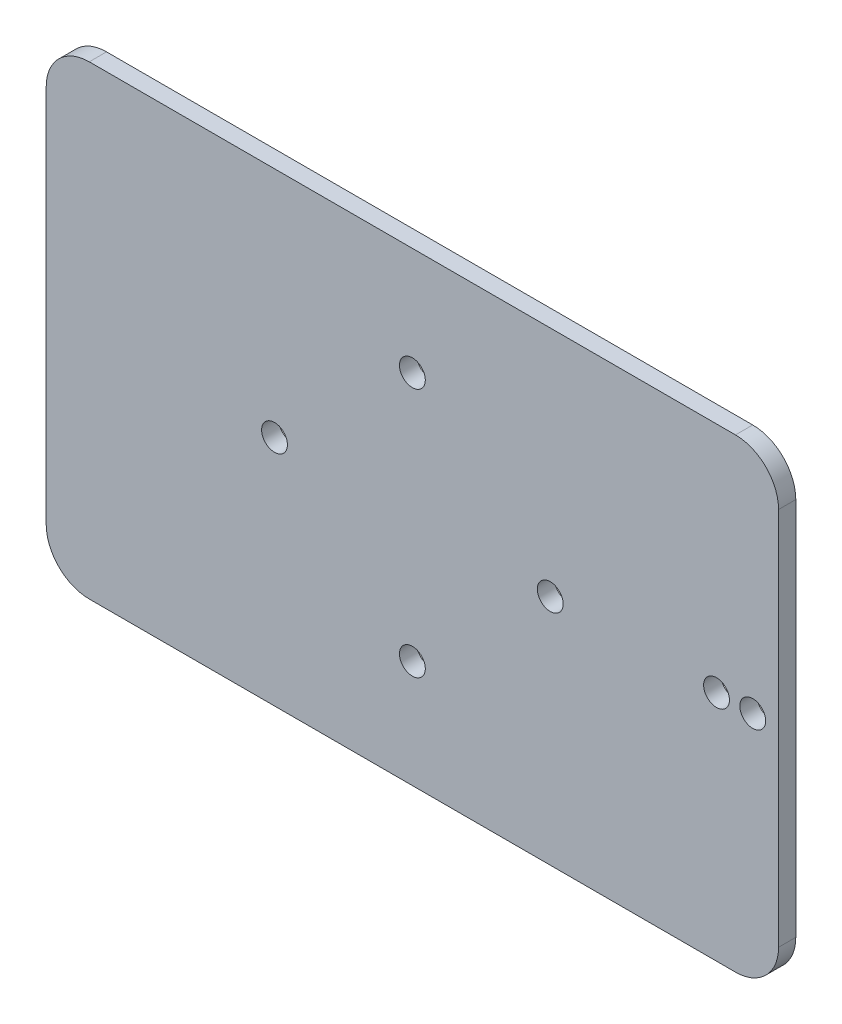
ISO-10303-21;
HEADER;
FILE_DESCRIPTION(('STEP AP214'),'2;1');
FILE_NAME('part.step','',(''),(''),'','','');
FILE_SCHEMA(('AUTOMOTIVE_DESIGN { 1 0 10303 214 1 1 1 1 }'));
ENDSEC;
DATA;
#1=APPLICATION_CONTEXT('core data for automotive mechanical design processes');
#2=APPLICATION_PROTOCOL_DEFINITION('international standard','automotive_design',2000,#1);
#3=PRODUCT_CONTEXT('',#1,'mechanical');
#4=PRODUCT('Part','Part','',(#3));
#5=PRODUCT_RELATED_PRODUCT_CATEGORY('part','',(#4));
#6=PRODUCT_DEFINITION_FORMATION('','',#4);
#7=PRODUCT_DEFINITION_CONTEXT('part definition',#1,'design');
#8=PRODUCT_DEFINITION('design','',#6,#7);
#9=PRODUCT_DEFINITION_SHAPE('','',#8);
#10=(LENGTH_UNIT() NAMED_UNIT(*) SI_UNIT(.MILLI.,.METRE.));
#11=(NAMED_UNIT(*) PLANE_ANGLE_UNIT() SI_UNIT($,.RADIAN.));
#12=(NAMED_UNIT(*) SI_UNIT($,.STERADIAN.) SOLID_ANGLE_UNIT());
#13=UNCERTAINTY_MEASURE_WITH_UNIT(LENGTH_MEASURE(1.E-05),#10,'distance_accuracy_value','');
#14=(GEOMETRIC_REPRESENTATION_CONTEXT(3) GLOBAL_UNCERTAINTY_ASSIGNED_CONTEXT((#13)) GLOBAL_UNIT_ASSIGNED_CONTEXT((#10,
#11,#12)) REPRESENTATION_CONTEXT('',''));
#15=CARTESIAN_POINT('',(0.,0.,0.));
#16=DIRECTION('',(0.,0.,1.));
#17=DIRECTION('',(1.,0.,0.));
#18=AXIS2_PLACEMENT_3D('',#15,#16,#17);
#19=CARTESIAN_POINT('',(0.,0.,2.));
#20=DIRECTION('',(0.,0.,1.));
#21=DIRECTION('',(1.,0.,0.));
#22=AXIS2_PLACEMENT_3D('',#19,#20,#21);
#23=PLANE('',#22);
#24=CARTESIAN_POINT('',(16.,0.,2.));
#25=DIRECTION('',(0.,0.,1.));
#26=DIRECTION('',(-1.,0.,0.));
#27=AXIS2_PLACEMENT_3D('',#24,#25,#26);
#28=CIRCLE('',#27,1.5);
#29=CARTESIAN_POINT('',(14.5,0.,2.));
#30=VERTEX_POINT('',#29);
#31=EDGE_CURVE('E265',#30,#30,#28,.T.);
#32=ORIENTED_EDGE('',*,*,#31,.F.);
#33=EDGE_LOOP('',(#32));
#34=FACE_BOUND('',#33,.T.);
#35=CARTESIAN_POINT('',(35.3,0.,2.));
#36=DIRECTION('',(0.,0.,1.));
#37=DIRECTION('',(1.,0.,0.));
#38=AXIS2_PLACEMENT_3D('',#35,#36,#37);
#39=CIRCLE('',#38,1.5);
#40=CARTESIAN_POINT('',(36.8,0.,2.));
#41=VERTEX_POINT('',#40);
#42=EDGE_CURVE('E281',#41,#41,#39,.T.);
#43=ORIENTED_EDGE('',*,*,#42,.F.);
#44=EDGE_LOOP('',(#43));
#45=FACE_BOUND('',#44,.T.);
#46=CARTESIAN_POINT('',(39.5,0.,2.));
#47=DIRECTION('',(0.,0.,1.));
#48=DIRECTION('',(1.,0.,0.));
#49=AXIS2_PLACEMENT_3D('',#46,#47,#48);
#50=CIRCLE('',#49,1.5);
#51=CARTESIAN_POINT('',(41.,0.,2.));
#52=VERTEX_POINT('',#51);
#53=EDGE_CURVE('E193',#52,#52,#50,.T.);
#54=ORIENTED_EDGE('',*,*,#53,.F.);
#55=EDGE_LOOP('',(#54));
#56=FACE_BOUND('',#55,.T.);
#57=DIRECTION('',(0.,-1.,0.));
#58=VECTOR('',#57,1.);
#59=CARTESIAN_POINT('',(-42.5,27.,2.));
#60=LINE('',#59,#58);
#61=CARTESIAN_POINT('',(-42.5,22.,2.));
#62=VERTEX_POINT('',#61);
#63=CARTESIAN_POINT('',(-42.5,-22.,2.));
#64=VERTEX_POINT('',#63);
#65=EDGE_CURVE('E181',#62,#64,#60,.T.);
#66=ORIENTED_EDGE('',*,*,#65,.T.);
#67=CARTESIAN_POINT('',(-37.5,-22.,2.));
#68=DIRECTION('',(0.,0.,1.));
#69=DIRECTION('',(1.,0.,0.));
#70=AXIS2_PLACEMENT_3D('',#67,#68,#69);
#71=CIRCLE('',#70,5.);
#72=CARTESIAN_POINT('',(-37.5,-27.,2.));
#73=VERTEX_POINT('',#72);
#74=EDGE_CURVE('E169',#64,#73,#71,.T.);
#75=ORIENTED_EDGE('',*,*,#74,.T.);
#76=DIRECTION('',(1.,0.,0.));
#77=VECTOR('',#76,1.);
#78=CARTESIAN_POINT('',(-42.5,-27.,2.));
#79=LINE('',#78,#77);
#80=CARTESIAN_POINT('',(37.5,-27.,2.));
#81=VERTEX_POINT('',#80);
#82=EDGE_CURVE('E127',#73,#81,#79,.T.);
#83=ORIENTED_EDGE('',*,*,#82,.T.);
#84=CARTESIAN_POINT('',(37.5,-22.,2.));
#85=DIRECTION('',(0.,0.,1.));
#86=DIRECTION('',(1.,0.,0.));
#87=AXIS2_PLACEMENT_3D('',#84,#85,#86);
#88=CIRCLE('',#87,5.);
#89=CARTESIAN_POINT('',(42.5,-22.,2.));
#90=VERTEX_POINT('',#89);
#91=EDGE_CURVE('E166',#81,#90,#88,.T.);
#92=ORIENTED_EDGE('',*,*,#91,.T.);
#93=DIRECTION('',(0.,1.,0.));
#94=VECTOR('',#93,1.);
#95=CARTESIAN_POINT('',(42.5,27.,2.));
#96=LINE('',#95,#94);
#97=CARTESIAN_POINT('',(42.5,22.,2.));
#98=VERTEX_POINT('',#97);
#99=EDGE_CURVE('E136',#90,#98,#96,.T.);
#100=ORIENTED_EDGE('',*,*,#99,.T.);
#101=CARTESIAN_POINT('',(37.5,22.,2.));
#102=DIRECTION('',(0.,0.,1.));
#103=DIRECTION('',(1.,0.,0.));
#104=AXIS2_PLACEMENT_3D('',#101,#102,#103);
#105=CIRCLE('',#104,5.);
#106=CARTESIAN_POINT('',(37.5,27.,2.));
#107=VERTEX_POINT('',#106);
#108=EDGE_CURVE('E61',#98,#107,#105,.T.);
#109=ORIENTED_EDGE('',*,*,#108,.T.);
#110=DIRECTION('',(-1.,0.,0.));
#111=VECTOR('',#110,1.);
#112=CARTESIAN_POINT('',(-42.5,27.,2.));
#113=LINE('',#112,#111);
#114=CARTESIAN_POINT('',(-37.5,27.,2.));
#115=VERTEX_POINT('',#114);
#116=EDGE_CURVE('E141',#107,#115,#113,.T.);
#117=ORIENTED_EDGE('',*,*,#116,.T.);
#118=CARTESIAN_POINT('',(-37.5,22.,2.));
#119=DIRECTION('',(0.,0.,1.));
#120=DIRECTION('',(1.,0.,0.));
#121=AXIS2_PLACEMENT_3D('',#118,#119,#120);
#122=CIRCLE('',#121,5.);
#123=EDGE_CURVE('E161',#115,#62,#122,.T.);
#124=ORIENTED_EDGE('',*,*,#123,.T.);
#125=EDGE_LOOP('',(#66,#75,#83,#92,#100,#109,#117,#124));
#126=FACE_BOUND('',#125,.T.);
#127=CARTESIAN_POINT('',(0.,14.5,2.));
#128=DIRECTION('',(0.,0.,1.));
#129=DIRECTION('',(1.,0.,0.));
#130=AXIS2_PLACEMENT_3D('',#127,#128,#129);
#131=CIRCLE('',#130,1.5);
#132=CARTESIAN_POINT('',(1.5,14.5,2.));
#133=VERTEX_POINT('',#132);
#134=EDGE_CURVE('E289',#133,#133,#131,.T.);
#135=ORIENTED_EDGE('',*,*,#134,.F.);
#136=EDGE_LOOP('',(#135));
#137=FACE_BOUND('',#136,.T.);
#138=CARTESIAN_POINT('',(-16.,0.,2.));
#139=DIRECTION('',(0.,0.,1.));
#140=DIRECTION('',(1.,0.,0.));
#141=AXIS2_PLACEMENT_3D('',#138,#139,#140);
#142=CIRCLE('',#141,1.5);
#143=CARTESIAN_POINT('',(-14.5,0.,2.));
#144=VERTEX_POINT('',#143);
#145=EDGE_CURVE('E273',#144,#144,#142,.T.);
#146=ORIENTED_EDGE('',*,*,#145,.F.);
#147=EDGE_LOOP('',(#146));
#148=FACE_BOUND('',#147,.T.);
#149=CARTESIAN_POINT('',(0.,-14.5,2.));
#150=DIRECTION('',(0.,0.,1.));
#151=DIRECTION('',(-1.,0.,0.));
#152=AXIS2_PLACEMENT_3D('',#149,#150,#151);
#153=CIRCLE('',#152,1.5);
#154=CARTESIAN_POINT('',(-1.5,-14.5,2.));
#155=VERTEX_POINT('',#154);
#156=EDGE_CURVE('E254',#155,#155,#153,.T.);
#157=ORIENTED_EDGE('',*,*,#156,.F.);
#158=EDGE_LOOP('',(#157));
#159=FACE_BOUND('',#158,.T.);
#160=ADVANCED_FACE('F39',(#34,#45,#56,#126,#137,#148,#159),#23,.T.);
#161=CARTESIAN_POINT('',(0.,0.,0.));
#162=DIRECTION('',(0.,0.,1.));
#163=DIRECTION('',(1.,0.,0.));
#164=AXIS2_PLACEMENT_3D('',#161,#162,#163);
#165=PLANE('',#164);
#166=DIRECTION('',(1.,0.,0.));
#167=VECTOR('',#166,1.);
#168=CARTESIAN_POINT('',(-42.5,-27.,0.));
#169=LINE('',#168,#167);
#170=CARTESIAN_POINT('',(-37.5,-27.,0.));
#171=VERTEX_POINT('',#170);
#172=CARTESIAN_POINT('',(37.5,-27.,0.));
#173=VERTEX_POINT('',#172);
#174=EDGE_CURVE('E124',#171,#173,#169,.T.);
#175=ORIENTED_EDGE('',*,*,#174,.F.);
#176=CARTESIAN_POINT('',(-37.5,-22.,0.));
#177=DIRECTION('',(0.,0.,1.));
#178=DIRECTION('',(1.,0.,0.));
#179=AXIS2_PLACEMENT_3D('',#176,#177,#178);
#180=CIRCLE('',#179,5.);
#181=CARTESIAN_POINT('',(-42.5,-22.,0.));
#182=VERTEX_POINT('',#181);
#183=EDGE_CURVE('E106',#171,#182,#180,.F.);
#184=ORIENTED_EDGE('',*,*,#183,.T.);
#185=DIRECTION('',(0.,-1.,0.));
#186=VECTOR('',#185,1.);
#187=CARTESIAN_POINT('',(-42.5,27.,0.));
#188=LINE('',#187,#186);
#189=CARTESIAN_POINT('',(-42.5,22.,0.));
#190=VERTEX_POINT('',#189);
#191=EDGE_CURVE('E137',#190,#182,#188,.T.);
#192=ORIENTED_EDGE('',*,*,#191,.F.);
#193=CARTESIAN_POINT('',(-37.5,22.,0.));
#194=DIRECTION('',(0.,0.,1.));
#195=DIRECTION('',(1.,0.,0.));
#196=AXIS2_PLACEMENT_3D('',#193,#194,#195);
#197=CIRCLE('',#196,5.);
#198=CARTESIAN_POINT('',(-37.5,27.,0.));
#199=VERTEX_POINT('',#198);
#200=EDGE_CURVE('E129',#190,#199,#197,.F.);
#201=ORIENTED_EDGE('',*,*,#200,.T.);
#202=DIRECTION('',(-1.,0.,0.));
#203=VECTOR('',#202,1.);
#204=CARTESIAN_POINT('',(-42.5,27.,0.));
#205=LINE('',#204,#203);
#206=CARTESIAN_POINT('',(37.5,27.,0.));
#207=VERTEX_POINT('',#206);
#208=EDGE_CURVE('E143',#207,#199,#205,.T.);
#209=ORIENTED_EDGE('',*,*,#208,.F.);
#210=CARTESIAN_POINT('',(37.5,22.,0.));
#211=DIRECTION('',(0.,0.,1.));
#212=DIRECTION('',(1.,0.,0.));
#213=AXIS2_PLACEMENT_3D('',#210,#211,#212);
#214=CIRCLE('',#213,5.);
#215=CARTESIAN_POINT('',(42.5,22.,0.));
#216=VERTEX_POINT('',#215);
#217=EDGE_CURVE('E151',#207,#216,#214,.F.);
#218=ORIENTED_EDGE('',*,*,#217,.T.);
#219=DIRECTION('',(0.,1.,0.));
#220=VECTOR('',#219,1.);
#221=CARTESIAN_POINT('',(42.5,27.,0.));
#222=LINE('',#221,#220);
#223=CARTESIAN_POINT('',(42.5,-22.,0.));
#224=VERTEX_POINT('',#223);
#225=EDGE_CURVE('E190',#224,#216,#222,.T.);
#226=ORIENTED_EDGE('',*,*,#225,.F.);
#227=CARTESIAN_POINT('',(37.5,-22.,0.));
#228=DIRECTION('',(0.,0.,1.));
#229=DIRECTION('',(1.,0.,0.));
#230=AXIS2_PLACEMENT_3D('',#227,#228,#229);
#231=CIRCLE('',#230,5.);
#232=EDGE_CURVE('E118',#224,#173,#231,.F.);
#233=ORIENTED_EDGE('',*,*,#232,.T.);
#234=EDGE_LOOP('',(#175,#184,#192,#201,#209,#218,#226,#233));
#235=FACE_BOUND('',#234,.T.);
#236=CARTESIAN_POINT('',(39.5,0.,0.));
#237=DIRECTION('',(0.,0.,1.));
#238=DIRECTION('',(1.,0.,0.));
#239=AXIS2_PLACEMENT_3D('',#236,#237,#238);
#240=CIRCLE('',#239,1.5);
#241=CARTESIAN_POINT('',(41.,0.,0.));
#242=VERTEX_POINT('',#241);
#243=EDGE_CURVE('E293',#242,#242,#240,.T.);
#244=ORIENTED_EDGE('',*,*,#243,.T.);
#245=EDGE_LOOP('',(#244));
#246=FACE_BOUND('',#245,.T.);
#247=CARTESIAN_POINT('',(0.,14.5,0.));
#248=DIRECTION('',(0.,0.,1.));
#249=DIRECTION('',(1.,0.,0.));
#250=AXIS2_PLACEMENT_3D('',#247,#248,#249);
#251=CIRCLE('',#250,1.5);
#252=CARTESIAN_POINT('',(1.5,14.5,0.));
#253=VERTEX_POINT('',#252);
#254=EDGE_CURVE('E285',#253,#253,#251,.T.);
#255=ORIENTED_EDGE('',*,*,#254,.T.);
#256=EDGE_LOOP('',(#255));
#257=FACE_BOUND('',#256,.T.);
#258=CARTESIAN_POINT('',(35.3,0.,0.));
#259=DIRECTION('',(0.,0.,1.));
#260=DIRECTION('',(1.,0.,0.));
#261=AXIS2_PLACEMENT_3D('',#258,#259,#260);
#262=CIRCLE('',#261,1.5);
#263=CARTESIAN_POINT('',(36.8,0.,0.));
#264=VERTEX_POINT('',#263);
#265=EDGE_CURVE('E277',#264,#264,#262,.T.);
#266=ORIENTED_EDGE('',*,*,#265,.T.);
#267=EDGE_LOOP('',(#266));
#268=FACE_BOUND('',#267,.T.);
#269=CARTESIAN_POINT('',(-16.,0.,0.));
#270=DIRECTION('',(0.,0.,1.));
#271=DIRECTION('',(1.,0.,0.));
#272=AXIS2_PLACEMENT_3D('',#269,#270,#271);
#273=CIRCLE('',#272,1.5);
#274=CARTESIAN_POINT('',(-14.5,0.,0.));
#275=VERTEX_POINT('',#274);
#276=EDGE_CURVE('E269',#275,#275,#273,.T.);
#277=ORIENTED_EDGE('',*,*,#276,.T.);
#278=EDGE_LOOP('',(#277));
#279=FACE_BOUND('',#278,.T.);
#280=CARTESIAN_POINT('',(16.,0.,0.));
#281=DIRECTION('',(0.,0.,1.));
#282=DIRECTION('',(-1.,0.,0.));
#283=AXIS2_PLACEMENT_3D('',#280,#281,#282);
#284=CIRCLE('',#283,1.5);
#285=CARTESIAN_POINT('',(14.5,0.,0.));
#286=VERTEX_POINT('',#285);
#287=EDGE_CURVE('E262',#286,#286,#284,.T.);
#288=ORIENTED_EDGE('',*,*,#287,.T.);
#289=EDGE_LOOP('',(#288));
#290=FACE_BOUND('',#289,.T.);
#291=CARTESIAN_POINT('',(0.,-14.5,0.));
#292=DIRECTION('',(0.,0.,1.));
#293=DIRECTION('',(-1.,0.,0.));
#294=AXIS2_PLACEMENT_3D('',#291,#292,#293);
#295=CIRCLE('',#294,1.5);
#296=CARTESIAN_POINT('',(-1.5,-14.5,0.));
#297=VERTEX_POINT('',#296);
#298=EDGE_CURVE('E257',#297,#297,#295,.T.);
#299=ORIENTED_EDGE('',*,*,#298,.T.);
#300=EDGE_LOOP('',(#299));
#301=FACE_BOUND('',#300,.T.);
#302=ADVANCED_FACE('F132',(#235,#246,#257,#268,#279,#290,#301),#165,.F.);
#303=CARTESIAN_POINT('',(42.5,27.,2.));
#304=DIRECTION('',(-1.,0.,0.));
#305=DIRECTION('',(0.,0.,1.));
#306=AXIS2_PLACEMENT_3D('',#303,#304,#305);
#307=PLANE('',#306);
#308=ORIENTED_EDGE('',*,*,#99,.F.);
#309=DIRECTION('',(0.,0.,-1.));
#310=VECTOR('',#309,1.);
#311=CARTESIAN_POINT('',(42.5,-22.,2.));
#312=LINE('',#311,#310);
#313=EDGE_CURVE('E175',#90,#224,#312,.T.);
#314=ORIENTED_EDGE('',*,*,#313,.T.);
#315=ORIENTED_EDGE('',*,*,#225,.T.);
#316=DIRECTION('',(0.,0.,-1.));
#317=VECTOR('',#316,1.);
#318=CARTESIAN_POINT('',(42.5,22.,2.));
#319=LINE('',#318,#317);
#320=EDGE_CURVE('E172',#216,#98,#319,.F.);
#321=ORIENTED_EDGE('',*,*,#320,.T.);
#322=EDGE_LOOP('',(#308,#314,#315,#321));
#323=FACE_BOUND('',#322,.T.);
#324=ADVANCED_FACE('F212',(#323),#307,.F.);
#325=CARTESIAN_POINT('',(-42.5,27.,2.));
#326=DIRECTION('',(0.,-1.,0.));
#327=DIRECTION('',(0.,0.,-1.));
#328=AXIS2_PLACEMENT_3D('',#325,#326,#327);
#329=PLANE('',#328);
#330=ORIENTED_EDGE('',*,*,#116,.F.);
#331=DIRECTION('',(0.,0.,-1.));
#332=VECTOR('',#331,1.);
#333=CARTESIAN_POINT('',(37.5,27.,2.));
#334=LINE('',#333,#332);
#335=EDGE_CURVE('E11',#107,#207,#334,.T.);
#336=ORIENTED_EDGE('',*,*,#335,.T.);
#337=ORIENTED_EDGE('',*,*,#208,.T.);
#338=DIRECTION('',(0.,0.,-1.));
#339=VECTOR('',#338,1.);
#340=CARTESIAN_POINT('',(-37.5,27.,2.));
#341=LINE('',#340,#339);
#342=EDGE_CURVE('E48',#199,#115,#341,.F.);
#343=ORIENTED_EDGE('',*,*,#342,.T.);
#344=EDGE_LOOP('',(#330,#336,#337,#343));
#345=FACE_BOUND('',#344,.T.);
#346=ADVANCED_FACE('F196',(#345),#329,.F.);
#347=CARTESIAN_POINT('',(-42.5,27.,2.));
#348=DIRECTION('',(1.,0.,0.));
#349=DIRECTION('',(0.,0.,-1.));
#350=AXIS2_PLACEMENT_3D('',#347,#348,#349);
#351=PLANE('',#350);
#352=ORIENTED_EDGE('',*,*,#191,.T.);
#353=DIRECTION('',(0.,0.,-1.));
#354=VECTOR('',#353,1.);
#355=CARTESIAN_POINT('',(-42.5,-22.,2.));
#356=LINE('',#355,#354);
#357=EDGE_CURVE('E111',#182,#64,#356,.F.);
#358=ORIENTED_EDGE('',*,*,#357,.T.);
#359=ORIENTED_EDGE('',*,*,#65,.F.);
#360=DIRECTION('',(0.,0.,-1.));
#361=VECTOR('',#360,1.);
#362=CARTESIAN_POINT('',(-42.5,22.,2.));
#363=LINE('',#362,#361);
#364=EDGE_CURVE('E117',#62,#190,#363,.T.);
#365=ORIENTED_EDGE('',*,*,#364,.T.);
#366=EDGE_LOOP('',(#352,#358,#359,#365));
#367=FACE_BOUND('',#366,.T.);
#368=ADVANCED_FACE('F203',(#367),#351,.F.);
#369=CARTESIAN_POINT('',(-42.5,-27.,2.));
#370=DIRECTION('',(0.,1.,0.));
#371=DIRECTION('',(0.,0.,1.));
#372=AXIS2_PLACEMENT_3D('',#369,#370,#371);
#373=PLANE('',#372);
#374=ORIENTED_EDGE('',*,*,#82,.F.);
#375=DIRECTION('',(0.,0.,-1.));
#376=VECTOR('',#375,1.);
#377=CARTESIAN_POINT('',(-37.5,-27.,2.));
#378=LINE('',#377,#376);
#379=EDGE_CURVE('E110',#73,#171,#378,.T.);
#380=ORIENTED_EDGE('',*,*,#379,.T.);
#381=ORIENTED_EDGE('',*,*,#174,.T.);
#382=DIRECTION('',(0.,0.,-1.));
#383=VECTOR('',#382,1.);
#384=CARTESIAN_POINT('',(37.5,-27.,2.));
#385=LINE('',#384,#383);
#386=EDGE_CURVE('E130',#173,#81,#385,.F.);
#387=ORIENTED_EDGE('',*,*,#386,.T.);
#388=EDGE_LOOP('',(#374,#380,#381,#387));
#389=FACE_BOUND('',#388,.T.);
#390=ADVANCED_FACE('F123',(#389),#373,.F.);
#391=CARTESIAN_POINT('',(39.5,0.,2.));
#392=DIRECTION('',(0.,0.,-1.));
#393=DIRECTION('',(-1.,0.,0.));
#394=AXIS2_PLACEMENT_3D('',#391,#392,#393);
#395=CYLINDRICAL_SURFACE('',#394,1.5);
#396=ORIENTED_EDGE('',*,*,#53,.T.);
#397=EDGE_LOOP('',(#396));
#398=FACE_BOUND('',#397,.T.);
#399=ORIENTED_EDGE('',*,*,#243,.F.);
#400=EDGE_LOOP('',(#399));
#401=FACE_BOUND('',#400,.T.);
#402=ADVANCED_FACE('F210',(#398,#401),#395,.F.);
#403=CARTESIAN_POINT('',(0.,14.5,2.));
#404=DIRECTION('',(0.,0.,-1.));
#405=DIRECTION('',(-1.,0.,0.));
#406=AXIS2_PLACEMENT_3D('',#403,#404,#405);
#407=CYLINDRICAL_SURFACE('',#406,1.5);
#408=ORIENTED_EDGE('',*,*,#134,.T.);
#409=EDGE_LOOP('',(#408));
#410=FACE_BOUND('',#409,.T.);
#411=ORIENTED_EDGE('',*,*,#254,.F.);
#412=EDGE_LOOP('',(#411));
#413=FACE_BOUND('',#412,.T.);
#414=ADVANCED_FACE('F226',(#410,#413),#407,.F.);
#415=CARTESIAN_POINT('',(35.3,0.,2.));
#416=DIRECTION('',(0.,0.,-1.));
#417=DIRECTION('',(-1.,0.,0.));
#418=AXIS2_PLACEMENT_3D('',#415,#416,#417);
#419=CYLINDRICAL_SURFACE('',#418,1.5);
#420=ORIENTED_EDGE('',*,*,#42,.T.);
#421=EDGE_LOOP('',(#420));
#422=FACE_BOUND('',#421,.T.);
#423=ORIENTED_EDGE('',*,*,#265,.F.);
#424=EDGE_LOOP('',(#423));
#425=FACE_BOUND('',#424,.T.);
#426=ADVANCED_FACE('F230',(#422,#425),#419,.F.);
#427=CARTESIAN_POINT('',(-16.,0.,2.));
#428=DIRECTION('',(0.,0.,-1.));
#429=DIRECTION('',(-1.,0.,0.));
#430=AXIS2_PLACEMENT_3D('',#427,#428,#429);
#431=CYLINDRICAL_SURFACE('',#430,1.5);
#432=ORIENTED_EDGE('',*,*,#145,.T.);
#433=EDGE_LOOP('',(#432));
#434=FACE_BOUND('',#433,.T.);
#435=ORIENTED_EDGE('',*,*,#276,.F.);
#436=EDGE_LOOP('',(#435));
#437=FACE_BOUND('',#436,.T.);
#438=ADVANCED_FACE('F234',(#434,#437),#431,.F.);
#439=CARTESIAN_POINT('',(16.,0.,2.));
#440=DIRECTION('',(0.,0.,-1.));
#441=DIRECTION('',(-1.,0.,0.));
#442=AXIS2_PLACEMENT_3D('',#439,#440,#441);
#443=CYLINDRICAL_SURFACE('',#442,1.5);
#444=ORIENTED_EDGE('',*,*,#31,.T.);
#445=EDGE_LOOP('',(#444));
#446=FACE_BOUND('',#445,.T.);
#447=ORIENTED_EDGE('',*,*,#287,.F.);
#448=EDGE_LOOP('',(#447));
#449=FACE_BOUND('',#448,.T.);
#450=ADVANCED_FACE('F238',(#446,#449),#443,.F.);
#451=CARTESIAN_POINT('',(0.,-14.5,2.));
#452=DIRECTION('',(0.,0.,-1.));
#453=DIRECTION('',(-1.,0.,0.));
#454=AXIS2_PLACEMENT_3D('',#451,#452,#453);
#455=CYLINDRICAL_SURFACE('',#454,1.5);
#456=ORIENTED_EDGE('',*,*,#156,.T.);
#457=EDGE_LOOP('',(#456));
#458=FACE_BOUND('',#457,.T.);
#459=ORIENTED_EDGE('',*,*,#298,.F.);
#460=EDGE_LOOP('',(#459));
#461=FACE_BOUND('',#460,.T.);
#462=ADVANCED_FACE('F242',(#458,#461),#455,.F.);
#463=CARTESIAN_POINT('',(-37.5,-22.,2.));
#464=DIRECTION('',(0.,0.,-1.));
#465=DIRECTION('',(-1.,0.,0.));
#466=AXIS2_PLACEMENT_3D('',#463,#464,#465);
#467=CYLINDRICAL_SURFACE('',#466,5.);
#468=ORIENTED_EDGE('',*,*,#74,.F.);
#469=ORIENTED_EDGE('',*,*,#357,.F.);
#470=ORIENTED_EDGE('',*,*,#183,.F.);
#471=ORIENTED_EDGE('',*,*,#379,.F.);
#472=EDGE_LOOP('',(#468,#469,#470,#471));
#473=FACE_BOUND('',#472,.T.);
#474=ADVANCED_FACE('F109',(#473),#467,.T.);
#475=CARTESIAN_POINT('',(37.5,-22.,2.));
#476=DIRECTION('',(0.,0.,-1.));
#477=DIRECTION('',(-1.,0.,0.));
#478=AXIS2_PLACEMENT_3D('',#475,#476,#477);
#479=CYLINDRICAL_SURFACE('',#478,5.);
#480=ORIENTED_EDGE('',*,*,#91,.F.);
#481=ORIENTED_EDGE('',*,*,#386,.F.);
#482=ORIENTED_EDGE('',*,*,#232,.F.);
#483=ORIENTED_EDGE('',*,*,#313,.F.);
#484=EDGE_LOOP('',(#480,#481,#482,#483));
#485=FACE_BOUND('',#484,.T.);
#486=ADVANCED_FACE('F249',(#485),#479,.T.);
#487=CARTESIAN_POINT('',(37.5,22.,2.));
#488=DIRECTION('',(0.,0.,-1.));
#489=DIRECTION('',(-1.,0.,0.));
#490=AXIS2_PLACEMENT_3D('',#487,#488,#489);
#491=CYLINDRICAL_SURFACE('',#490,5.);
#492=ORIENTED_EDGE('',*,*,#108,.F.);
#493=ORIENTED_EDGE('',*,*,#320,.F.);
#494=ORIENTED_EDGE('',*,*,#217,.F.);
#495=ORIENTED_EDGE('',*,*,#335,.F.);
#496=EDGE_LOOP('',(#492,#493,#494,#495));
#497=FACE_BOUND('',#496,.T.);
#498=ADVANCED_FACE('F325',(#497),#491,.T.);
#499=CARTESIAN_POINT('',(-37.5,22.,2.));
#500=DIRECTION('',(0.,0.,-1.));
#501=DIRECTION('',(-1.,0.,0.));
#502=AXIS2_PLACEMENT_3D('',#499,#500,#501);
#503=CYLINDRICAL_SURFACE('',#502,5.);
#504=ORIENTED_EDGE('',*,*,#123,.F.);
#505=ORIENTED_EDGE('',*,*,#342,.F.);
#506=ORIENTED_EDGE('',*,*,#200,.F.);
#507=ORIENTED_EDGE('',*,*,#364,.F.);
#508=EDGE_LOOP('',(#504,#505,#506,#507));
#509=FACE_BOUND('',#508,.T.);
#510=ADVANCED_FACE('F41',(#509),#503,.T.);
#511=CLOSED_SHELL('',(#160,#302,#324,#346,#368,#390,#402,#414,#426,#438,#450,#462,#474,#486,
#498,#510));
#512=MANIFOLD_SOLID_BREP('B2',#511);
#513=ADVANCED_BREP_SHAPE_REPRESENTATION('',(#18,#512),#14);
#514=SHAPE_DEFINITION_REPRESENTATION(#9,#513);
ENDSEC;
END-ISO-10303-21;
